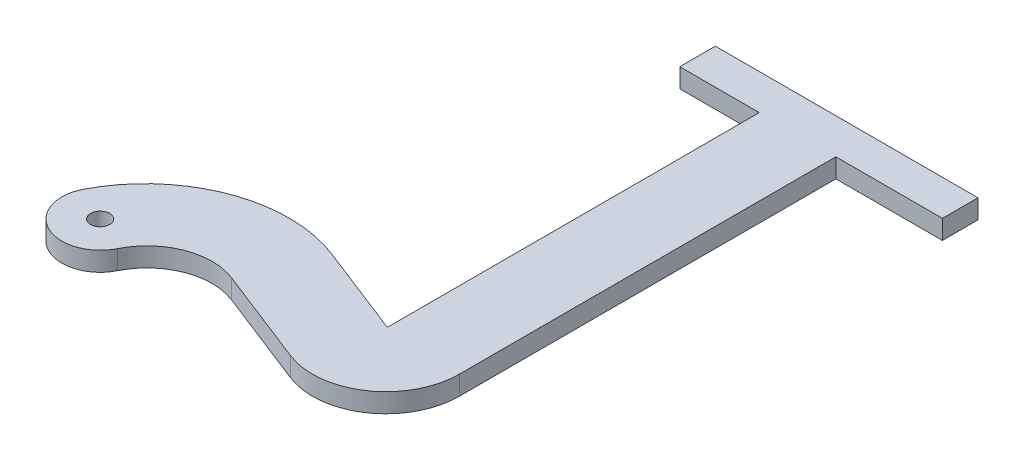
ISO-10303-21;
HEADER;
FILE_DESCRIPTION(('STEP AP214'),'2;1');
FILE_NAME('part.step','',(''),(''),'','','');
FILE_SCHEMA(('AUTOMOTIVE_DESIGN { 1 0 10303 214 1 1 1 1 }'));
ENDSEC;
DATA;
#1=APPLICATION_CONTEXT('core data for automotive mechanical design processes');
#2=APPLICATION_PROTOCOL_DEFINITION('international standard','automotive_design',2000,#1);
#3=PRODUCT_CONTEXT('',#1,'mechanical');
#4=PRODUCT('Part','Part','',(#3));
#5=PRODUCT_RELATED_PRODUCT_CATEGORY('part','',(#4));
#6=PRODUCT_DEFINITION_FORMATION('','',#4);
#7=PRODUCT_DEFINITION_CONTEXT('part definition',#1,'design');
#8=PRODUCT_DEFINITION('design','',#6,#7);
#9=PRODUCT_DEFINITION_SHAPE('','',#8);
#10=(LENGTH_UNIT() NAMED_UNIT(*) SI_UNIT(.MILLI.,.METRE.));
#11=(NAMED_UNIT(*) PLANE_ANGLE_UNIT() SI_UNIT($,.RADIAN.));
#12=(NAMED_UNIT(*) SI_UNIT($,.STERADIAN.) SOLID_ANGLE_UNIT());
#13=UNCERTAINTY_MEASURE_WITH_UNIT(LENGTH_MEASURE(1.E-05),#10,'distance_accuracy_value','');
#14=(GEOMETRIC_REPRESENTATION_CONTEXT(3) GLOBAL_UNCERTAINTY_ASSIGNED_CONTEXT((#13)) GLOBAL_UNIT_ASSIGNED_CONTEXT((#10,
#11,#12)) REPRESENTATION_CONTEXT('',''));
#15=CARTESIAN_POINT('',(0.,0.,0.));
#16=DIRECTION('',(0.,0.,1.));
#17=DIRECTION('',(1.,0.,0.));
#18=AXIS2_PLACEMENT_3D('',#15,#16,#17);
#19=CARTESIAN_POINT('',(24.2200709163837,5.,11.9702193941502));
#20=DIRECTION('',(0.,-1.,0.));
#21=DIRECTION('',(0.,0.,-1.));
#22=AXIS2_PLACEMENT_3D('',#19,#20,#21);
#23=PLANE('',#22);
#24=CARTESIAN_POINT('',(24.2200709163837,5.,11.9702193941502));
#25=DIRECTION('',(0.,-1.,0.));
#26=DIRECTION('',(0.,0.,-1.));
#27=AXIS2_PLACEMENT_3D('',#24,#25,#26);
#28=CIRCLE('',#27,17.0143479451694);
#29=CARTESIAN_POINT('',(8.96691754154105,5.,4.43169512723815));
#30=VERTEX_POINT('',#29);
#31=CARTESIAN_POINT('',(30.4164620375028,5.,-3.87568774534194));
#32=VERTEX_POINT('',#31);
#33=EDGE_CURVE('E187',#30,#32,#28,.T.);
#34=ORIENTED_EDGE('',*,*,#33,.T.);
#35=DIRECTION('',(0.93132614841058,0.,0.364186223362052));
#36=VECTOR('',#35,1.);
#37=CARTESIAN_POINT('',(30.4164620375028,5.,-3.87568774534194));
#38=LINE('',#37,#36);
#39=CARTESIAN_POINT('',(55.8232727078021,5.,6.05940367400886));
#40=VERTEX_POINT('',#39);
#41=EDGE_CURVE('E110',#32,#40,#38,.T.);
#42=ORIENTED_EDGE('',*,*,#41,.T.);
#43=CARTESIAN_POINT('',(62.8114707186493,5.,-11.8113753952551));
#44=DIRECTION('',(0.,1.,0.));
#45=DIRECTION('',(0.,0.,1.));
#46=AXIS2_PLACEMENT_3D('',#43,#44,#45);
#47=CIRCLE('',#46,19.1885292813507);
#48=CARTESIAN_POINT('',(82.,5.,-11.8113753952551));
#49=VERTEX_POINT('',#48);
#50=EDGE_CURVE('E217',#40,#49,#47,.T.);
#51=ORIENTED_EDGE('',*,*,#50,.T.);
#52=DIRECTION('',(0.,0.,-1.));
#53=VECTOR('',#52,1.);
#54=CARTESIAN_POINT('',(82.,5.,-11.8113753952551));
#55=LINE('',#54,#53);
#56=CARTESIAN_POINT('',(82.,5.,-110.123102525288));
#57=VERTEX_POINT('',#56);
#58=EDGE_CURVE('E236',#49,#57,#55,.T.);
#59=ORIENTED_EDGE('',*,*,#58,.T.);
#60=DIRECTION('',(1.,0.,0.));
#61=VECTOR('',#60,1.);
#62=CARTESIAN_POINT('',(82.,5.,-110.123102525288));
#63=LINE('',#62,#61);
#64=CARTESIAN_POINT('',(109.832159842862,5.,-110.123102525288));
#65=VERTEX_POINT('',#64);
#66=EDGE_CURVE('E233',#57,#65,#63,.T.);
#67=ORIENTED_EDGE('',*,*,#66,.T.);
#68=DIRECTION('',(0.,0.,-1.));
#69=VECTOR('',#68,1.);
#70=CARTESIAN_POINT('',(109.832159842862,5.,-110.123102525288));
#71=LINE('',#70,#69);
#72=CARTESIAN_POINT('',(109.832159842862,5.,-119.415014129389));
#73=VERTEX_POINT('',#72);
#74=EDGE_CURVE('E235',#65,#73,#71,.T.);
#75=ORIENTED_EDGE('',*,*,#74,.T.);
#76=DIRECTION('',(-1.,0.,0.));
#77=VECTOR('',#76,1.);
#78=CARTESIAN_POINT('',(109.832159842862,5.,-119.415014129389));
#79=LINE('',#78,#77);
#80=CARTESIAN_POINT('',(41.2524344760619,5.,-119.415014129389));
#81=VERTEX_POINT('',#80);
#82=EDGE_CURVE('E238',#73,#81,#79,.T.);
#83=ORIENTED_EDGE('',*,*,#82,.T.);
#84=DIRECTION('',(0.,0.,1.));
#85=VECTOR('',#84,1.);
#86=CARTESIAN_POINT('',(41.2524344760619,5.,-119.415014129389));
#87=LINE('',#86,#85);
#88=CARTESIAN_POINT('',(41.2524344760619,5.,-110.123102525288));
#89=VERTEX_POINT('',#88);
#90=EDGE_CURVE('E244',#81,#89,#87,.T.);
#91=ORIENTED_EDGE('',*,*,#90,.T.);
#92=DIRECTION('',(1.,0.,0.));
#93=VECTOR('',#92,1.);
#94=CARTESIAN_POINT('',(41.2524344760619,5.,-110.123102525288));
#95=LINE('',#94,#93);
#96=CARTESIAN_POINT('',(62.,5.,-110.123102525288));
#97=VERTEX_POINT('',#96);
#98=EDGE_CURVE('E246',#89,#97,#95,.T.);
#99=ORIENTED_EDGE('',*,*,#98,.T.);
#100=DIRECTION('',(0.,0.,1.));
#101=VECTOR('',#100,1.);
#102=CARTESIAN_POINT('',(62.,5.,-110.123102525288));
#103=LINE('',#102,#101);
#104=CARTESIAN_POINT('',(62.,5.,-13.));
#105=VERTEX_POINT('',#104);
#106=EDGE_CURVE('E144',#97,#105,#103,.T.);
#107=ORIENTED_EDGE('',*,*,#106,.T.);
#108=DIRECTION('',(-0.93132614841058,0.,-0.364186223362051));
#109=VECTOR('',#108,1.);
#110=CARTESIAN_POINT('',(62.,5.,-13.));
#111=LINE('',#110,#109);
#112=CARTESIAN_POINT('',(38.1730841434603,5.,-22.3172885942993));
#113=VERTEX_POINT('',#112);
#114=EDGE_CURVE('E138',#105,#113,#111,.T.);
#115=ORIENTED_EDGE('',*,*,#114,.T.);
#116=CARTESIAN_POINT('',(24.487611623785,5.,12.6802966884838));
#117=DIRECTION('',(0.,1.,0.));
#118=DIRECTION('',(0.,0.,1.));
#119=AXIS2_PLACEMENT_3D('',#116,#117,#118);
#120=CIRCLE('',#119,37.5782268569509);
#121=CARTESIAN_POINT('',(-8.88208216346986,5.,-4.5993639059063));
#122=VERTEX_POINT('',#121);
#123=EDGE_CURVE('E142',#113,#122,#120,.T.);
#124=ORIENTED_EDGE('',*,*,#123,.T.);
#125=CARTESIAN_POINT('',(0.,5.,0.));
#126=DIRECTION('',(0.,1.,0.));
#127=DIRECTION('',(0.,0.,-1.));
#128=AXIS2_PLACEMENT_3D('',#125,#126,#127);
#129=CIRCLE('',#128,10.0022763357939);
#130=EDGE_CURVE('E52',#122,#30,#129,.T.);
#131=ORIENTED_EDGE('',*,*,#130,.T.);
#132=EDGE_LOOP('',(#34,#42,#51,#59,#67,#75,#83,#91,#99,#107,#115,#124,#131));
#133=FACE_BOUND('',#132,.T.);
#134=CARTESIAN_POINT('',(0.,5.,0.));
#135=DIRECTION('',(0.,1.,0.));
#136=DIRECTION('',(0.,0.,1.));
#137=AXIS2_PLACEMENT_3D('',#134,#135,#136);
#138=CIRCLE('',#137,2.5);
#139=CARTESIAN_POINT('',(0.,5.,2.5));
#140=VERTEX_POINT('',#139);
#141=EDGE_CURVE('E166',#140,#140,#138,.T.);
#142=ORIENTED_EDGE('',*,*,#141,.F.);
#143=EDGE_LOOP('',(#142));
#144=FACE_BOUND('',#143,.T.);
#145=ADVANCED_FACE('F35',(#133,#144),#23,.F.);
#146=CARTESIAN_POINT('',(24.2200709163837,0.,11.9702193941502));
#147=DIRECTION('',(0.,-1.,0.));
#148=DIRECTION('',(0.,0.,-1.));
#149=AXIS2_PLACEMENT_3D('',#146,#147,#148);
#150=PLANE('',#149);
#151=CARTESIAN_POINT('',(24.2200709163837,0.,11.9702193941502));
#152=DIRECTION('',(0.,-1.,0.));
#153=DIRECTION('',(0.,0.,-1.));
#154=AXIS2_PLACEMENT_3D('',#151,#152,#153);
#155=CIRCLE('',#154,17.0143479451694);
#156=CARTESIAN_POINT('',(8.96691754154105,0.,4.43169512723815));
#157=VERTEX_POINT('',#156);
#158=CARTESIAN_POINT('',(30.4164620375028,0.,-3.87568774534194));
#159=VERTEX_POINT('',#158);
#160=EDGE_CURVE('E162',#157,#159,#155,.T.);
#161=ORIENTED_EDGE('',*,*,#160,.F.);
#162=CARTESIAN_POINT('',(0.,0.,0.));
#163=DIRECTION('',(0.,1.,0.));
#164=DIRECTION('',(0.,0.,-1.));
#165=AXIS2_PLACEMENT_3D('',#162,#163,#164);
#166=CIRCLE('',#165,10.0022763357939);
#167=CARTESIAN_POINT('',(-8.88208216346986,0.,-4.5993639059063));
#168=VERTEX_POINT('',#167);
#169=EDGE_CURVE('E102',#168,#157,#166,.T.);
#170=ORIENTED_EDGE('',*,*,#169,.F.);
#171=CARTESIAN_POINT('',(24.487611623785,0.,12.6802966884838));
#172=DIRECTION('',(0.,1.,0.));
#173=DIRECTION('',(0.,0.,1.));
#174=AXIS2_PLACEMENT_3D('',#171,#172,#173);
#175=CIRCLE('',#174,37.5782268569509);
#176=CARTESIAN_POINT('',(38.1730841434603,0.,-22.3172885942993));
#177=VERTEX_POINT('',#176);
#178=EDGE_CURVE('E96',#177,#168,#175,.T.);
#179=ORIENTED_EDGE('',*,*,#178,.F.);
#180=DIRECTION('',(-0.93132614841058,0.,-0.364186223362051));
#181=VECTOR('',#180,1.);
#182=CARTESIAN_POINT('',(62.,0.,-13.));
#183=LINE('',#182,#181);
#184=CARTESIAN_POINT('',(62.,0.,-13.));
#185=VERTEX_POINT('',#184);
#186=EDGE_CURVE('E152',#185,#177,#183,.T.);
#187=ORIENTED_EDGE('',*,*,#186,.F.);
#188=DIRECTION('',(0.,0.,1.));
#189=VECTOR('',#188,1.);
#190=CARTESIAN_POINT('',(62.,0.,-110.123102525288));
#191=LINE('',#190,#189);
#192=CARTESIAN_POINT('',(62.,0.,-110.123102525288));
#193=VERTEX_POINT('',#192);
#194=EDGE_CURVE('E182',#193,#185,#191,.T.);
#195=ORIENTED_EDGE('',*,*,#194,.F.);
#196=DIRECTION('',(1.,0.,0.));
#197=VECTOR('',#196,1.);
#198=CARTESIAN_POINT('',(41.2524344760619,0.,-110.123102525288));
#199=LINE('',#198,#197);
#200=CARTESIAN_POINT('',(41.2524344760619,0.,-110.123102525288));
#201=VERTEX_POINT('',#200);
#202=EDGE_CURVE('E180',#201,#193,#199,.T.);
#203=ORIENTED_EDGE('',*,*,#202,.F.);
#204=DIRECTION('',(0.,0.,1.));
#205=VECTOR('',#204,1.);
#206=CARTESIAN_POINT('',(41.2524344760619,0.,-119.415014129389));
#207=LINE('',#206,#205);
#208=CARTESIAN_POINT('',(41.2524344760619,0.,-119.415014129389));
#209=VERTEX_POINT('',#208);
#210=EDGE_CURVE('E178',#209,#201,#207,.T.);
#211=ORIENTED_EDGE('',*,*,#210,.F.);
#212=DIRECTION('',(-1.,0.,0.));
#213=VECTOR('',#212,1.);
#214=CARTESIAN_POINT('',(109.832159842862,0.,-119.415014129389));
#215=LINE('',#214,#213);
#216=CARTESIAN_POINT('',(109.832159842862,0.,-119.415014129389));
#217=VERTEX_POINT('',#216);
#218=EDGE_CURVE('E176',#217,#209,#215,.T.);
#219=ORIENTED_EDGE('',*,*,#218,.F.);
#220=DIRECTION('',(0.,0.,-1.));
#221=VECTOR('',#220,1.);
#222=CARTESIAN_POINT('',(109.832159842862,0.,-110.123102525288));
#223=LINE('',#222,#221);
#224=CARTESIAN_POINT('',(109.832159842862,0.,-110.123102525288));
#225=VERTEX_POINT('',#224);
#226=EDGE_CURVE('E174',#225,#217,#223,.T.);
#227=ORIENTED_EDGE('',*,*,#226,.F.);
#228=DIRECTION('',(1.,0.,0.));
#229=VECTOR('',#228,1.);
#230=CARTESIAN_POINT('',(82.,0.,-110.123102525288));
#231=LINE('',#230,#229);
#232=CARTESIAN_POINT('',(82.,0.,-110.123102525288));
#233=VERTEX_POINT('',#232);
#234=EDGE_CURVE('E172',#233,#225,#231,.T.);
#235=ORIENTED_EDGE('',*,*,#234,.F.);
#236=DIRECTION('',(0.,0.,-1.));
#237=VECTOR('',#236,1.);
#238=CARTESIAN_POINT('',(82.,0.,-11.8113753952551));
#239=LINE('',#238,#237);
#240=CARTESIAN_POINT('',(82.,0.,-11.8113753952551));
#241=VERTEX_POINT('',#240);
#242=EDGE_CURVE('E170',#241,#233,#239,.T.);
#243=ORIENTED_EDGE('',*,*,#242,.F.);
#244=CARTESIAN_POINT('',(62.8114707186493,0.,-11.8113753952551));
#245=DIRECTION('',(0.,1.,0.));
#246=DIRECTION('',(0.,0.,1.));
#247=AXIS2_PLACEMENT_3D('',#244,#245,#246);
#248=CIRCLE('',#247,19.1885292813507);
#249=CARTESIAN_POINT('',(55.8232727078021,0.,6.05940367400886));
#250=VERTEX_POINT('',#249);
#251=EDGE_CURVE('E168',#250,#241,#248,.T.);
#252=ORIENTED_EDGE('',*,*,#251,.F.);
#253=DIRECTION('',(0.93132614841058,0.,0.364186223362052));
#254=VECTOR('',#253,1.);
#255=CARTESIAN_POINT('',(30.4164620375028,0.,-3.87568774534194));
#256=LINE('',#255,#254);
#257=EDGE_CURVE('E165',#159,#250,#256,.T.);
#258=ORIENTED_EDGE('',*,*,#257,.F.);
#259=EDGE_LOOP('',(#161,#170,#179,#187,#195,#203,#211,#219,#227,#235,#243,#252,#258));
#260=FACE_BOUND('',#259,.T.);
#261=CARTESIAN_POINT('',(0.,0.,0.));
#262=DIRECTION('',(0.,1.,0.));
#263=DIRECTION('',(0.,0.,1.));
#264=AXIS2_PLACEMENT_3D('',#261,#262,#263);
#265=CIRCLE('',#264,2.5);
#266=CARTESIAN_POINT('',(0.,0.,2.5));
#267=VERTEX_POINT('',#266);
#268=EDGE_CURVE('E406',#267,#267,#265,.T.);
#269=ORIENTED_EDGE('',*,*,#268,.T.);
#270=EDGE_LOOP('',(#269));
#271=FACE_BOUND('',#270,.T.);
#272=ADVANCED_FACE('F221',(#260,#271),#150,.T.);
#273=CARTESIAN_POINT('',(24.2200709163837,5.,11.9702193941502));
#274=DIRECTION('',(0.,-1.,0.));
#275=DIRECTION('',(0.,0.,-1.));
#276=AXIS2_PLACEMENT_3D('',#273,#274,#275);
#277=CYLINDRICAL_SURFACE('',#276,17.0143479451694);
#278=ORIENTED_EDGE('',*,*,#160,.T.);
#279=DIRECTION('',(0.,-1.,0.));
#280=VECTOR('',#279,1.);
#281=CARTESIAN_POINT('',(30.4164620375028,5.,-3.87568774534194));
#282=LINE('',#281,#280);
#283=EDGE_CURVE('E11',#32,#159,#282,.T.);
#284=ORIENTED_EDGE('',*,*,#283,.F.);
#285=ORIENTED_EDGE('',*,*,#33,.F.);
#286=DIRECTION('',(0.,-1.,0.));
#287=VECTOR('',#286,1.);
#288=CARTESIAN_POINT('',(8.96691754154105,5.,4.43169512723815));
#289=LINE('',#288,#287);
#290=EDGE_CURVE('E158',#30,#157,#289,.T.);
#291=ORIENTED_EDGE('',*,*,#290,.T.);
#292=EDGE_LOOP('',(#278,#284,#285,#291));
#293=FACE_BOUND('',#292,.T.);
#294=ADVANCED_FACE('F37',(#293),#277,.F.);
#295=CARTESIAN_POINT('',(30.4164620375028,5.,-3.87568774534194));
#296=DIRECTION('',(0.364186223362052,0.,-0.93132614841058));
#297=DIRECTION('',(-0.93132614841058,0.,-0.364186223362052));
#298=AXIS2_PLACEMENT_3D('',#295,#296,#297);
#299=PLANE('',#298);
#300=ORIENTED_EDGE('',*,*,#257,.T.);
#301=DIRECTION('',(0.,-1.,0.));
#302=VECTOR('',#301,1.);
#303=CARTESIAN_POINT('',(55.8232727078021,5.,6.05940367400886));
#304=LINE('',#303,#302);
#305=EDGE_CURVE('E44',#40,#250,#304,.T.);
#306=ORIENTED_EDGE('',*,*,#305,.F.);
#307=ORIENTED_EDGE('',*,*,#41,.F.);
#308=ORIENTED_EDGE('',*,*,#283,.T.);
#309=EDGE_LOOP('',(#300,#306,#307,#308));
#310=FACE_BOUND('',#309,.T.);
#311=ADVANCED_FACE('F280',(#310),#299,.F.);
#312=CARTESIAN_POINT('',(62.8114707186493,5.,-11.8113753952551));
#313=DIRECTION('',(0.,-1.,0.));
#314=DIRECTION('',(0.,0.,-1.));
#315=AXIS2_PLACEMENT_3D('',#312,#313,#314);
#316=CYLINDRICAL_SURFACE('',#315,19.1885292813507);
#317=ORIENTED_EDGE('',*,*,#251,.T.);
#318=DIRECTION('',(0.,-1.,0.));
#319=VECTOR('',#318,1.);
#320=CARTESIAN_POINT('',(82.,5.,-11.8113753952551));
#321=LINE('',#320,#319);
#322=EDGE_CURVE('E209',#49,#241,#321,.T.);
#323=ORIENTED_EDGE('',*,*,#322,.F.);
#324=ORIENTED_EDGE('',*,*,#50,.F.);
#325=ORIENTED_EDGE('',*,*,#305,.T.);
#326=EDGE_LOOP('',(#317,#323,#324,#325));
#327=FACE_BOUND('',#326,.T.);
#328=ADVANCED_FACE('F215',(#327),#316,.T.);
#329=CARTESIAN_POINT('',(82.,5.,-11.8113753952551));
#330=DIRECTION('',(-1.,0.,0.));
#331=DIRECTION('',(0.,0.,1.));
#332=AXIS2_PLACEMENT_3D('',#329,#330,#331);
#333=PLANE('',#332);
#334=ORIENTED_EDGE('',*,*,#242,.T.);
#335=DIRECTION('',(0.,-1.,0.));
#336=VECTOR('',#335,1.);
#337=CARTESIAN_POINT('',(82.,5.,-110.123102525288));
#338=LINE('',#337,#336);
#339=EDGE_CURVE('E206',#57,#233,#338,.T.);
#340=ORIENTED_EDGE('',*,*,#339,.F.);
#341=ORIENTED_EDGE('',*,*,#58,.F.);
#342=ORIENTED_EDGE('',*,*,#322,.T.);
#343=EDGE_LOOP('',(#334,#340,#341,#342));
#344=FACE_BOUND('',#343,.T.);
#345=ADVANCED_FACE('F227',(#344),#333,.F.);
#346=CARTESIAN_POINT('',(82.,5.,-110.123102525288));
#347=DIRECTION('',(0.,0.,-1.));
#348=DIRECTION('',(-1.,0.,0.));
#349=AXIS2_PLACEMENT_3D('',#346,#347,#348);
#350=PLANE('',#349);
#351=ORIENTED_EDGE('',*,*,#234,.T.);
#352=DIRECTION('',(0.,-1.,0.));
#353=VECTOR('',#352,1.);
#354=CARTESIAN_POINT('',(109.832159842862,5.,-110.123102525288));
#355=LINE('',#354,#353);
#356=EDGE_CURVE('E203',#65,#225,#355,.T.);
#357=ORIENTED_EDGE('',*,*,#356,.F.);
#358=ORIENTED_EDGE('',*,*,#66,.F.);
#359=ORIENTED_EDGE('',*,*,#339,.T.);
#360=EDGE_LOOP('',(#351,#357,#358,#359));
#361=FACE_BOUND('',#360,.T.);
#362=ADVANCED_FACE('F231',(#361),#350,.F.);
#363=CARTESIAN_POINT('',(109.832159842862,5.,-110.123102525288));
#364=DIRECTION('',(-1.,0.,0.));
#365=DIRECTION('',(0.,0.,1.));
#366=AXIS2_PLACEMENT_3D('',#363,#364,#365);
#367=PLANE('',#366);
#368=ORIENTED_EDGE('',*,*,#226,.T.);
#369=DIRECTION('',(0.,-1.,0.));
#370=VECTOR('',#369,1.);
#371=CARTESIAN_POINT('',(109.832159842862,5.,-119.415014129389));
#372=LINE('',#371,#370);
#373=EDGE_CURVE('E200',#73,#217,#372,.T.);
#374=ORIENTED_EDGE('',*,*,#373,.F.);
#375=ORIENTED_EDGE('',*,*,#74,.F.);
#376=ORIENTED_EDGE('',*,*,#356,.T.);
#377=EDGE_LOOP('',(#368,#374,#375,#376));
#378=FACE_BOUND('',#377,.T.);
#379=ADVANCED_FACE('F293',(#378),#367,.F.);
#380=CARTESIAN_POINT('',(109.832159842862,5.,-119.415014129389));
#381=DIRECTION('',(0.,0.,1.));
#382=DIRECTION('',(1.,0.,0.));
#383=AXIS2_PLACEMENT_3D('',#380,#381,#382);
#384=PLANE('',#383);
#385=ORIENTED_EDGE('',*,*,#218,.T.);
#386=DIRECTION('',(0.,-1.,0.));
#387=VECTOR('',#386,1.);
#388=CARTESIAN_POINT('',(41.2524344760619,5.,-119.415014129389));
#389=LINE('',#388,#387);
#390=EDGE_CURVE('E197',#81,#209,#389,.T.);
#391=ORIENTED_EDGE('',*,*,#390,.F.);
#392=ORIENTED_EDGE('',*,*,#82,.F.);
#393=ORIENTED_EDGE('',*,*,#373,.T.);
#394=EDGE_LOOP('',(#385,#391,#392,#393));
#395=FACE_BOUND('',#394,.T.);
#396=ADVANCED_FACE('F296',(#395),#384,.F.);
#397=CARTESIAN_POINT('',(41.2524344760619,5.,-119.415014129389));
#398=DIRECTION('',(1.,0.,0.));
#399=DIRECTION('',(0.,0.,-1.));
#400=AXIS2_PLACEMENT_3D('',#397,#398,#399);
#401=PLANE('',#400);
#402=ORIENTED_EDGE('',*,*,#210,.T.);
#403=DIRECTION('',(0.,-1.,0.));
#404=VECTOR('',#403,1.);
#405=CARTESIAN_POINT('',(41.2524344760619,5.,-110.123102525288));
#406=LINE('',#405,#404);
#407=EDGE_CURVE('E194',#89,#201,#406,.T.);
#408=ORIENTED_EDGE('',*,*,#407,.F.);
#409=ORIENTED_EDGE('',*,*,#90,.F.);
#410=ORIENTED_EDGE('',*,*,#390,.T.);
#411=EDGE_LOOP('',(#402,#408,#409,#410));
#412=FACE_BOUND('',#411,.T.);
#413=ADVANCED_FACE('F300',(#412),#401,.F.);
#414=CARTESIAN_POINT('',(41.2524344760619,5.,-110.123102525288));
#415=DIRECTION('',(0.,0.,-1.));
#416=DIRECTION('',(-1.,0.,0.));
#417=AXIS2_PLACEMENT_3D('',#414,#415,#416);
#418=PLANE('',#417);
#419=ORIENTED_EDGE('',*,*,#202,.T.);
#420=DIRECTION('',(0.,-1.,0.));
#421=VECTOR('',#420,1.);
#422=CARTESIAN_POINT('',(62.,5.,-110.123102525288));
#423=LINE('',#422,#421);
#424=EDGE_CURVE('E191',#97,#193,#423,.T.);
#425=ORIENTED_EDGE('',*,*,#424,.F.);
#426=ORIENTED_EDGE('',*,*,#98,.F.);
#427=ORIENTED_EDGE('',*,*,#407,.T.);
#428=EDGE_LOOP('',(#419,#425,#426,#427));
#429=FACE_BOUND('',#428,.T.);
#430=ADVANCED_FACE('F252',(#429),#418,.F.);
#431=CARTESIAN_POINT('',(62.,5.,-110.123102525288));
#432=DIRECTION('',(1.,0.,0.));
#433=DIRECTION('',(0.,0.,-1.));
#434=AXIS2_PLACEMENT_3D('',#431,#432,#433);
#435=PLANE('',#434);
#436=ORIENTED_EDGE('',*,*,#194,.T.);
#437=DIRECTION('',(0.,-1.,0.));
#438=VECTOR('',#437,1.);
#439=CARTESIAN_POINT('',(62.,5.,-13.));
#440=LINE('',#439,#438);
#441=EDGE_CURVE('E153',#105,#185,#440,.T.);
#442=ORIENTED_EDGE('',*,*,#441,.F.);
#443=ORIENTED_EDGE('',*,*,#106,.F.);
#444=ORIENTED_EDGE('',*,*,#424,.T.);
#445=EDGE_LOOP('',(#436,#442,#443,#444));
#446=FACE_BOUND('',#445,.T.);
#447=ADVANCED_FACE('F256',(#446),#435,.F.);
#448=CARTESIAN_POINT('',(62.,5.,-13.));
#449=DIRECTION('',(-0.364186223362051,0.,0.93132614841058));
#450=DIRECTION('',(0.93132614841058,0.,0.364186223362051));
#451=AXIS2_PLACEMENT_3D('',#448,#449,#450);
#452=PLANE('',#451);
#453=ORIENTED_EDGE('',*,*,#186,.T.);
#454=DIRECTION('',(0.,-1.,0.));
#455=VECTOR('',#454,1.);
#456=CARTESIAN_POINT('',(38.1730841434603,5.,-22.3172885942993));
#457=LINE('',#456,#455);
#458=EDGE_CURVE('E149',#113,#177,#457,.T.);
#459=ORIENTED_EDGE('',*,*,#458,.F.);
#460=ORIENTED_EDGE('',*,*,#114,.F.);
#461=ORIENTED_EDGE('',*,*,#441,.T.);
#462=EDGE_LOOP('',(#453,#459,#460,#461));
#463=FACE_BOUND('',#462,.T.);
#464=ADVANCED_FACE('F150',(#463),#452,.F.);
#465=CARTESIAN_POINT('',(24.487611623785,5.,12.6802966884838));
#466=DIRECTION('',(0.,-1.,0.));
#467=DIRECTION('',(0.,0.,-1.));
#468=AXIS2_PLACEMENT_3D('',#465,#466,#467);
#469=CYLINDRICAL_SURFACE('',#468,37.5782268569509);
#470=ORIENTED_EDGE('',*,*,#178,.T.);
#471=DIRECTION('',(0.,-1.,0.));
#472=VECTOR('',#471,1.);
#473=CARTESIAN_POINT('',(-8.88208216346986,5.,-4.5993639059063));
#474=LINE('',#473,#472);
#475=EDGE_CURVE('E154',#122,#168,#474,.T.);
#476=ORIENTED_EDGE('',*,*,#475,.F.);
#477=ORIENTED_EDGE('',*,*,#123,.F.);
#478=ORIENTED_EDGE('',*,*,#458,.T.);
#479=EDGE_LOOP('',(#470,#476,#477,#478));
#480=FACE_BOUND('',#479,.T.);
#481=ADVANCED_FACE('F156',(#480),#469,.T.);
#482=CARTESIAN_POINT('',(0.,5.,0.));
#483=DIRECTION('',(0.,-1.,0.));
#484=DIRECTION('',(0.,0.,-1.));
#485=AXIS2_PLACEMENT_3D('',#482,#483,#484);
#486=CYLINDRICAL_SURFACE('',#485,10.0022763357939);
#487=ORIENTED_EDGE('',*,*,#169,.T.);
#488=ORIENTED_EDGE('',*,*,#290,.F.);
#489=ORIENTED_EDGE('',*,*,#130,.F.);
#490=ORIENTED_EDGE('',*,*,#475,.T.);
#491=EDGE_LOOP('',(#487,#488,#489,#490));
#492=FACE_BOUND('',#491,.T.);
#493=ADVANCED_FACE('F260',(#492),#486,.T.);
#494=CARTESIAN_POINT('',(0.,5.,0.));
#495=DIRECTION('',(0.,-1.,0.));
#496=DIRECTION('',(0.,0.,-1.));
#497=AXIS2_PLACEMENT_3D('',#494,#495,#496);
#498=CYLINDRICAL_SURFACE('',#497,2.5);
#499=ORIENTED_EDGE('',*,*,#141,.T.);
#500=EDGE_LOOP('',(#499));
#501=FACE_BOUND('',#500,.T.);
#502=ORIENTED_EDGE('',*,*,#268,.F.);
#503=EDGE_LOOP('',(#502));
#504=FACE_BOUND('',#503,.T.);
#505=ADVANCED_FACE('F262',(#501,#504),#498,.F.);
#506=CLOSED_SHELL('',(#145,#272,#294,#311,#328,#345,#362,#379,#396,#413,#430,#447,#464,#481,
#493,#505));
#507=MANIFOLD_SOLID_BREP('B2',#506);
#508=ADVANCED_BREP_SHAPE_REPRESENTATION('',(#18,#507),#14);
#509=SHAPE_DEFINITION_REPRESENTATION(#9,#508);
ENDSEC;
END-ISO-10303-21;
